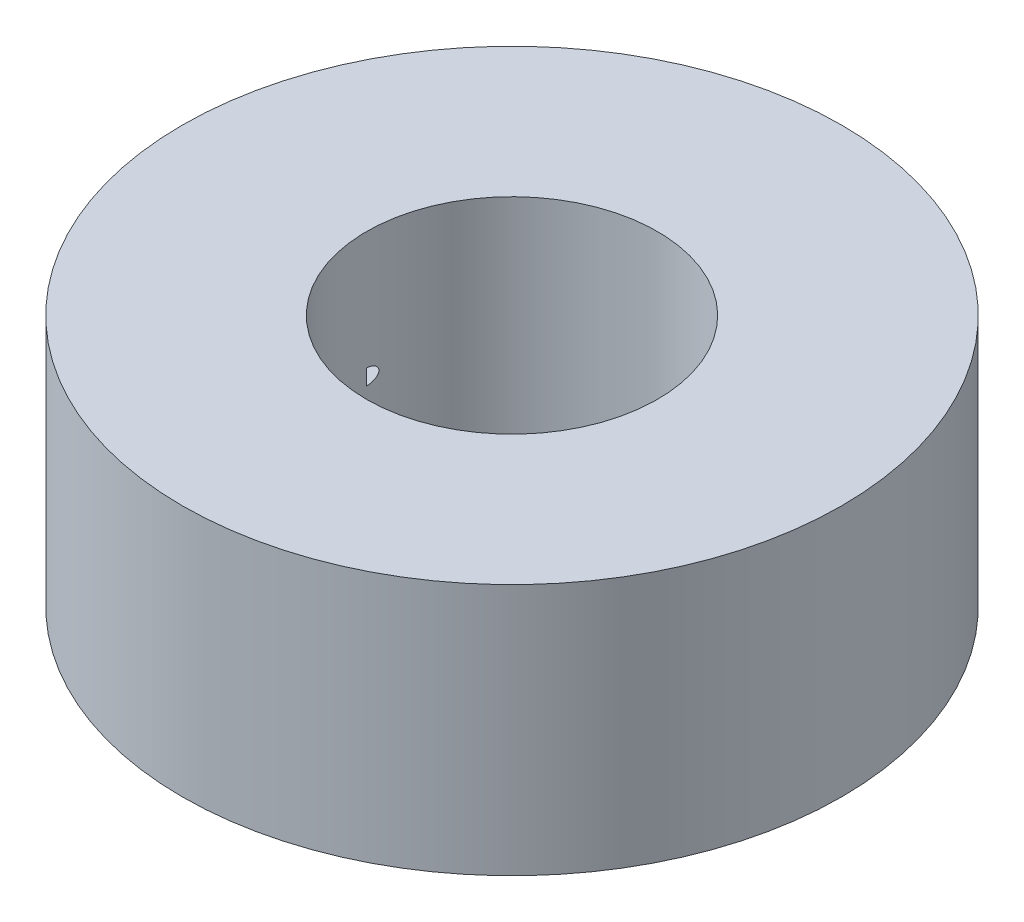
ISO-10303-21;
HEADER;
FILE_DESCRIPTION(('STEP AP214'),'2;1');
FILE_NAME('part.step','',(''),(''),'','','');
FILE_SCHEMA(('AUTOMOTIVE_DESIGN { 1 0 10303 214 1 1 1 1 }'));
ENDSEC;
DATA;
#1=APPLICATION_CONTEXT('core data for automotive mechanical design processes');
#2=APPLICATION_PROTOCOL_DEFINITION('international standard','automotive_design',2000,#1);
#3=PRODUCT_CONTEXT('',#1,'mechanical');
#4=PRODUCT('Part','Part','',(#3));
#5=PRODUCT_RELATED_PRODUCT_CATEGORY('part','',(#4));
#6=PRODUCT_DEFINITION_FORMATION('','',#4);
#7=PRODUCT_DEFINITION_CONTEXT('part definition',#1,'design');
#8=PRODUCT_DEFINITION('design','',#6,#7);
#9=PRODUCT_DEFINITION_SHAPE('','',#8);
#10=(LENGTH_UNIT() NAMED_UNIT(*) SI_UNIT(.MILLI.,.METRE.));
#11=(NAMED_UNIT(*) PLANE_ANGLE_UNIT() SI_UNIT($,.RADIAN.));
#12=(NAMED_UNIT(*) SI_UNIT($,.STERADIAN.) SOLID_ANGLE_UNIT());
#13=UNCERTAINTY_MEASURE_WITH_UNIT(LENGTH_MEASURE(1.E-05),#10,'distance_accuracy_value','');
#14=(GEOMETRIC_REPRESENTATION_CONTEXT(3) GLOBAL_UNCERTAINTY_ASSIGNED_CONTEXT((#13)) GLOBAL_UNIT_ASSIGNED_CONTEXT((#10,
#11,#12)) REPRESENTATION_CONTEXT('',''));
#15=CARTESIAN_POINT('',(0.,0.,0.));
#16=DIRECTION('',(0.,0.,1.));
#17=DIRECTION('',(1.,0.,0.));
#18=AXIS2_PLACEMENT_3D('',#15,#16,#17);
#19=CARTESIAN_POINT('',(0.,13.,0.));
#20=DIRECTION('',(0.,1.,0.));
#21=DIRECTION('',(0.,0.,1.));
#22=AXIS2_PLACEMENT_3D('',#19,#20,#21);
#23=PLANE('',#22);
#24=CARTESIAN_POINT('',(0.,13.,0.));
#25=DIRECTION('',(0.,1.,0.));
#26=DIRECTION('',(0.,0.,1.));
#27=AXIS2_PLACEMENT_3D('',#24,#25,#26);
#28=CIRCLE('',#27,17.);
#29=CARTESIAN_POINT('',(0.,13.,17.));
#30=VERTEX_POINT('',#29);
#31=EDGE_CURVE('E71',#30,#30,#28,.T.);
#32=ORIENTED_EDGE('',*,*,#31,.T.);
#33=EDGE_LOOP('',(#32));
#34=FACE_BOUND('',#33,.T.);
#35=CARTESIAN_POINT('',(0.,13.,0.));
#36=DIRECTION('',(0.,1.,0.));
#37=DIRECTION('',(0.,0.,1.));
#38=AXIS2_PLACEMENT_3D('',#35,#36,#37);
#39=CIRCLE('',#38,7.5);
#40=CARTESIAN_POINT('',(0.,13.,7.5));
#41=VERTEX_POINT('',#40);
#42=EDGE_CURVE('E84',#41,#41,#39,.T.);
#43=ORIENTED_EDGE('',*,*,#42,.F.);
#44=EDGE_LOOP('',(#43));
#45=FACE_BOUND('',#44,.T.);
#46=ADVANCED_FACE('F43',(#34,#45),#23,.T.);
#47=CARTESIAN_POINT('',(0.,0.,0.));
#48=DIRECTION('',(0.,1.,0.));
#49=DIRECTION('',(0.,0.,1.));
#50=AXIS2_PLACEMENT_3D('',#47,#48,#49);
#51=PLANE('',#50);
#52=CARTESIAN_POINT('',(0.,0.,0.));
#53=DIRECTION('',(0.,1.,0.));
#54=DIRECTION('',(0.,0.,1.));
#55=AXIS2_PLACEMENT_3D('',#52,#53,#54);
#56=CIRCLE('',#55,17.);
#57=CARTESIAN_POINT('',(0.,0.,17.));
#58=VERTEX_POINT('',#57);
#59=EDGE_CURVE('E93',#58,#58,#56,.T.);
#60=ORIENTED_EDGE('',*,*,#59,.F.);
#61=EDGE_LOOP('',(#60));
#62=FACE_BOUND('',#61,.T.);
#63=CARTESIAN_POINT('',(0.,0.,0.));
#64=DIRECTION('',(0.,1.,0.));
#65=DIRECTION('',(0.,0.,1.));
#66=AXIS2_PLACEMENT_3D('',#63,#64,#65);
#67=CIRCLE('',#66,7.5);
#68=CARTESIAN_POINT('',(0.,0.,7.5));
#69=VERTEX_POINT('',#68);
#70=EDGE_CURVE('E87',#69,#69,#67,.T.);
#71=ORIENTED_EDGE('',*,*,#70,.T.);
#72=EDGE_LOOP('',(#71));
#73=FACE_BOUND('',#72,.T.);
#74=ADVANCED_FACE('F106',(#62,#73),#51,.F.);
#75=CARTESIAN_POINT('',(0.,13.,0.));
#76=DIRECTION('',(0.,-1.,0.));
#77=DIRECTION('',(0.,0.,-1.));
#78=AXIS2_PLACEMENT_3D('',#75,#76,#77);
#79=CYLINDRICAL_SURFACE('',#78,17.);
#80=CARTESIAN_POINT('',(-7.475,6.5,-15.2684110175224));
#81=CARTESIAN_POINT('',(-7.47500759504641,6.66343449378337,-15.2684088996109));
#82=CARTESIAN_POINT('',(-7.48767649308095,6.82693018495944,-15.2622249028304));
#83=CARTESIAN_POINT('',(-7.53779248223485,7.14916430516422,-15.2375338182105));
#84=CARTESIAN_POINT('',(-7.57525282552799,7.30790014236735,-15.2190201395526));
#85=CARTESIAN_POINT('',(-7.67315757281746,7.6158366823646,-15.1698919898576));
#86=CARTESIAN_POINT('',(-7.7335659457595,7.76505190683336,-15.1392964857204));
#87=CARTESIAN_POINT('',(-7.87469379615572,8.05036863613705,-15.0663690071125));
#88=CARTESIAN_POINT('',(-7.95541250038644,8.18647063992547,-15.0240374794312));
#89=CARTESIAN_POINT('',(-8.13623257015441,8.44609826793165,-14.9269051506459));
#90=CARTESIAN_POINT('',(-8.23680001232593,8.56918300173224,-14.8717974618524));
#91=CARTESIAN_POINT('',(-8.45181445084686,8.79632080040588,-14.7506627217098));
#92=CARTESIAN_POINT('',(-8.56626503615109,8.90036892658205,-14.6846328452363));
#93=CARTESIAN_POINT('',(-8.81564939579281,9.09675894933656,-14.5364074195656));
#94=CARTESIAN_POINT('',(-8.95149958520011,9.18724065319495,-14.4532970017542));
#95=CARTESIAN_POINT('',(-9.23017215644443,9.34435305175559,-14.2769451261159));
#96=CARTESIAN_POINT('',(-9.37299788772716,9.41097215782768,-14.183698774449));
#97=CARTESIAN_POINT('',(-9.68229608359314,9.5290853394495,-13.9747169315902));
#98=CARTESIAN_POINT('',(-9.84922654002488,9.57704858940845,-13.8576729815623));
#99=CARTESIAN_POINT('',(-10.1823131410459,9.64496944922897,-13.6148117643494));
#100=CARTESIAN_POINT('',(-10.3484688513516,9.6649128836442,-13.4889900902051));
#101=CARTESIAN_POINT('',(-10.707834345909,9.68048613446572,-13.2062088463142));
#102=CARTESIAN_POINT('',(-10.9001864082182,9.67077660446095,-13.0478751348036));
#103=CARTESIAN_POINT('',(-11.2753064795698,9.61858046218148,-12.7251246004236));
#104=CARTESIAN_POINT('',(-11.458064047701,9.57605890179027,-12.5607014695869));
#105=CARTESIAN_POINT('',(-11.7401429456633,9.4840472388896,-12.295938237365));
#106=CARTESIAN_POINT('',(-11.8434884422771,9.44421902186781,-12.1963897925465));
#107=CARTESIAN_POINT('',(-12.0453134401381,9.35410873835973,-11.997104056725));
#108=CARTESIAN_POINT('',(-12.1437939447448,9.30382883867025,-11.8973668091038));
#109=CARTESIAN_POINT('',(-12.3354920802252,9.19295571011705,-11.6984920587124));
#110=CARTESIAN_POINT('',(-12.4287080107939,9.13235917435941,-11.5993547588339));
#111=CARTESIAN_POINT('',(-12.6093317025306,9.00082298777691,-11.4027444347095));
#112=CARTESIAN_POINT('',(-12.6967414375217,8.92988687836992,-11.3052708533404));
#113=CARTESIAN_POINT('',(-12.9017194836116,8.74431780268388,-11.0715430990724));
#114=CARTESIAN_POINT('',(-13.0159670299532,8.62406035925907,-10.9367632008247));
#115=CARTESIAN_POINT('',(-13.2287432408449,8.35995023630518,-10.6783977605614));
#116=CARTESIAN_POINT('',(-13.3273013786682,8.21614285306154,-10.5547914219646));
#117=CARTESIAN_POINT('',(-13.4753866938656,7.95345998299938,-10.36453010001));
#118=CARTESIAN_POINT('',(-13.5304356332074,7.84168539303104,-10.2924266638517));
#119=CARTESIAN_POINT('',(-13.628948558485,7.60578617360689,-10.1616157344114));
#120=CARTESIAN_POINT('',(-13.6724311091888,7.4816817794918,-10.1028867963034));
#121=CARTESIAN_POINT('',(-13.736993922554,7.24986710750895,-10.0148559321733));
#122=CARTESIAN_POINT('',(-13.7608767642558,7.14433019568585,-9.98194638393483));
#123=CARTESIAN_POINT('',(-13.7979313937265,6.9279666526358,-9.93066502127737));
#124=CARTESIAN_POINT('',(-13.8111153992489,6.81714620866538,-9.91227662478103));
#125=CARTESIAN_POINT('',(-13.8256508275,6.59260246118597,-9.8919944479524));
#126=CARTESIAN_POINT('',(-13.8269407691124,6.4788671187164,-9.89018637253833));
#127=CARTESIAN_POINT('',(-13.8173915479639,6.25290264584977,-9.90352198984109));
#128=CARTESIAN_POINT('',(-13.8065475915965,6.140674128469,-9.91867238215523));
#129=CARTESIAN_POINT('',(-13.7749103267186,5.92881963075548,-9.96255462961252));
#130=CARTESIAN_POINT('',(-13.7548643053207,5.82886077252776,-9.9902646988287));
#131=CARTESIAN_POINT('',(-13.7064777492401,5.63479157865507,-10.0565478300734));
#132=CARTESIAN_POINT('',(-13.678133923658,5.54068358144209,-10.0951252018315));
#133=CARTESIAN_POINT('',(-13.5940457074684,5.30075446684918,-10.2083061598827));
#134=CARTESIAN_POINT('',(-13.5323817244905,5.16043877208655,-10.2901545002255));
#135=CARTESIAN_POINT('',(-13.3947673424735,4.89716525312842,-10.4686663588138));
#136=CARTESIAN_POINT('',(-13.3187702851989,4.77426648114196,-10.5653780656582));
#137=CARTESIAN_POINT('',(-13.1739750073254,4.57074678129132,-10.7450719782249));
#138=CARTESIAN_POINT('',(-13.1074279005956,4.48684649241124,-10.8262213514806));
#139=CARTESIAN_POINT('',(-12.9684035931134,4.32818832768357,-10.9923719100638));
#140=CARTESIAN_POINT('',(-12.8959232018327,4.25343542531294,-11.0773751566429));
#141=CARTESIAN_POINT('',(-12.7456460230897,4.11263787426503,-11.2499607278766));
#142=CARTESIAN_POINT('',(-12.6678456427969,4.04659920067067,-11.3375447722845));
#143=CARTESIAN_POINT('',(-12.5074466582028,3.92303206704372,-11.5142529153891));
#144=CARTESIAN_POINT('',(-12.4248488569056,3.86550218847253,-11.6033767546066));
#145=CARTESIAN_POINT('',(-12.2516599574633,3.75660737849578,-11.7861494949845));
#146=CARTESIAN_POINT('',(-12.1608791309981,3.70559992504822,-11.8798320187006));
#147=CARTESIAN_POINT('',(-11.9748545394187,3.61275290599283,-12.0673256460899));
#148=CARTESIAN_POINT('',(-11.8796092916404,3.57091641268485,-12.1611367822905));
#149=CARTESIAN_POINT('',(-11.5878385248483,3.45953649373259,-12.4416429160165));
#150=CARTESIAN_POINT('',(-11.385044162391,3.40397581827145,-12.627658998711));
#151=CARTESIAN_POINT('',(-10.9747171706178,3.33507573749686,-12.9856418852582));
#152=CARTESIAN_POINT('',(-10.7676786416428,3.32017263032528,-13.1578736610158));
#153=CARTESIAN_POINT('',(-10.3463250381998,3.33255192786816,-13.4916826046523));
#154=CARTESIAN_POINT('',(-10.1320177886148,3.35979029342172,-13.6532707115733));
#155=CARTESIAN_POINT('',(-9.74422671905185,3.45173540851405,-13.9318233762862));
#156=CARTESIAN_POINT('',(-9.57075185978426,3.5083059216507,-14.0514210920509));
#157=CARTESIAN_POINT('',(-9.31487087845024,3.61786728263015,-14.2212431192798));
#158=CARTESIAN_POINT('',(-9.23026517468942,3.65852716134644,-14.2762753797456));
#159=CARTESIAN_POINT('',(-9.06334724208499,3.74825071642088,-14.3828199439169));
#160=CARTESIAN_POINT('',(-8.98103400025367,3.79731061023359,-14.4343338174174));
#161=CARTESIAN_POINT('',(-8.818914116816,3.90437479294155,-14.5339565682965));
#162=CARTESIAN_POINT('',(-8.73913608265938,3.9624543504881,-14.5820313017512));
#163=CARTESIAN_POINT('',(-8.58395308582577,4.08712342065501,-14.6739182071168));
#164=CARTESIAN_POINT('',(-8.5085458183436,4.15370838772184,-14.7177326339981));
#165=CARTESIAN_POINT('',(-8.36318839752624,4.29514207116197,-14.8008138164617));
#166=CARTESIAN_POINT('',(-8.29323714004673,4.36998910807895,-14.8400814929628));
#167=CARTESIAN_POINT('',(-8.15991591327914,4.52750255216234,-14.9138048852172));
#168=CARTESIAN_POINT('',(-8.09654459359628,4.61016734821617,-14.9482615888246));
#169=CARTESIAN_POINT('',(-7.98600126877898,4.77031670338444,-15.0075694055642));
#170=CARTESIAN_POINT('',(-7.93780865244759,4.84685152167109,-15.0330895116214));
#171=CARTESIAN_POINT('',(-7.84771529209526,5.00464822670698,-15.0803167022242));
#172=CARTESIAN_POINT('',(-7.80581357221314,5.08590937757553,-15.1020243782533));
#173=CARTESIAN_POINT('',(-7.72893273468596,5.25244641788726,-15.1415147197756));
#174=CARTESIAN_POINT('',(-7.69394578224846,5.33771762647093,-15.1593018301398));
#175=CARTESIAN_POINT('',(-7.63135186584927,5.51160066703146,-15.1909082515385));
#176=CARTESIAN_POINT('',(-7.60374316822038,5.60021170865493,-15.2047284947237));
#177=CARTESIAN_POINT('',(-7.54540634364697,5.82138986443807,-15.2337905045966));
#178=CARTESIAN_POINT('',(-7.51907037677765,5.95545178362204,-15.2467693623573));
#179=CARTESIAN_POINT('',(-7.48386550949665,6.22632847908405,-15.2640797706376));
#180=CARTESIAN_POINT('',(-7.47499364003958,6.36314278343705,-15.2684127910249));
#181=CARTESIAN_POINT('',(-7.475,6.5,-15.2684110175224));
#182=B_SPLINE_CURVE_WITH_KNOTS('',3,(#80,#81,#82,#83,#84,#85,#86,#87,#88,#89,#90,#91,#92,#93,
#94,#95,#96,#97,#98,#99,#100,#101,#102,#103,#104,#105,#106,#107,#108,#109,#110,#111,#112,#113,
#114,#115,#116,#117,#118,#119,#120,#121,#122,#123,#124,#125,#126,#127,#128,#129,#130,#131,#132,
#133,#134,#135,#136,#137,#138,#139,#140,#141,#142,#143,#144,#145,#146,#147,#148,#149,#150,#151,
#152,#153,#154,#155,#156,#157,#158,#159,#160,#161,#162,#163,#164,#165,#166,#167,#168,#169,#170,
#171,#172,#173,#174,#175,#176,#177,#178,#179,#180,#181),.UNSPECIFIED.,.T.,.F.,(4,2,2,2,2,2,2,2,
2,2,2,2,2,2,2,2,2,2,2,2,2,2,2,2,2,2,2,2,2,2,2,2,2,2,2,2,2,2,2,2,2,2,2,2,2,2,2,2,2,2,4),(0.,
0.48981092836701,0.979883895031607,1.4691905498274,1.95847857931629,2.46102915535442,
2.96370992457249,3.5110323143909,4.05862014658662,4.68460356572833,5.31090356093743,
6.05619664738001,6.80228464355319,7.24864695756506,7.69491682583388,8.14133001167331,
8.58759065381618,9.22699455499551,9.8651827591489,10.2958284939788,10.7257787869809,
11.0637405365946,11.4013157986479,11.7406350349961,12.0800883698291,12.3958481537543,
12.7117333376784,13.230038332244,13.7500606266585,14.1526263725632,14.5554100319072,
14.9584684484321,15.3614595933905,15.781268756447,16.2012183426636,17.040013729862,
17.8460611126369,18.6512667194097,19.3029120149182,19.6290031883382,19.9549479065162,
20.2837753486431,20.6124277847707,20.9410135373033,21.2695317206263,21.5510699834908,
21.8325645281401,22.1137382728571,22.3948458920258,22.8050748348124,23.2152340291577),.UNSPECIFIED.);
#183=CARTESIAN_POINT('',(-7.475,6.5,-15.2684110175224));
#184=VERTEX_POINT('',#183);
#185=EDGE_CURVE('E76',#184,#184,#182,.T.);
#186=ORIENTED_EDGE('',*,*,#185,.T.);
#187=EDGE_LOOP('',(#186));
#188=FACE_BOUND('',#187,.T.);
#189=ORIENTED_EDGE('',*,*,#31,.F.);
#190=EDGE_LOOP('',(#189));
#191=FACE_BOUND('',#190,.T.);
#192=ORIENTED_EDGE('',*,*,#59,.T.);
#193=EDGE_LOOP('',(#192));
#194=FACE_BOUND('',#193,.T.);
#195=ADVANCED_FACE('F45',(#188,#191,#194),#79,.T.);
#196=CARTESIAN_POINT('',(0.,13.,0.));
#197=DIRECTION('',(0.,-1.,0.));
#198=DIRECTION('',(0.,0.,-1.));
#199=AXIS2_PLACEMENT_3D('',#196,#197,#198);
#200=CYLINDRICAL_SURFACE('',#199,7.5);
#201=CARTESIAN_POINT('',(-7.5,6.10235065698534,0.));
#202=CARTESIAN_POINT('',(-7.50001716075797,6.10243344655008,-0.0454279085965253));
#203=CARTESIAN_POINT('',(-7.49958791711057,6.1056352670304,-0.0910029819151988));
#204=CARTESIAN_POINT('',(-7.49793357294347,6.11895139460656,-0.181664877714916));
#205=CARTESIAN_POINT('',(-7.49669885911321,6.12914927680271,-0.226739025785009));
#206=CARTESIAN_POINT('',(-7.49396304701072,6.1533722958314,-0.302585977917393));
#207=CARTESIAN_POINT('',(-7.49262430612961,6.1656164179316,-0.333929682771217));
#208=CARTESIAN_POINT('',(-7.489684823502,6.19463204321492,-0.394365059074159));
#209=CARTESIAN_POINT('',(-7.48808514308074,6.21138537832505,-0.423465177693709));
#210=CARTESIAN_POINT('',(-7.48533965105117,6.24364755167456,-0.469074474063028));
#211=CARTESIAN_POINT('',(-7.48421769748352,6.25775194375407,-0.486575918249042));
#212=CARTESIAN_POINT('',(-7.48201924898686,6.28843577938129,-0.519282753501265));
#213=CARTESIAN_POINT('',(-7.48094269964314,6.30501214563787,-0.534490952682823));
#214=CARTESIAN_POINT('',(-7.47917634998602,6.33662179365537,-0.558599555793345));
#215=CARTESIAN_POINT('',(-7.47845416196766,6.35115527154433,-0.56814856653045));
#216=CARTESIAN_POINT('',(-7.47717228454231,6.38159163701985,-0.584777100161183));
#217=CARTESIAN_POINT('',(-7.47661248391811,6.39749357763785,-0.591858313892291));
#218=CARTESIAN_POINT('',(-7.47571746891675,6.43050357185406,-0.603059674508457));
#219=CARTESIAN_POINT('',(-7.4753844327826,6.44762162588868,-0.607151129145431));
#220=CARTESIAN_POINT('',(-7.47500192670921,6.48233111198766,-0.611843428865015));
#221=CARTESIAN_POINT('',(-7.47495219558384,6.49992209300785,-0.612447489072554));
#222=CARTESIAN_POINT('',(-7.47512910018336,6.53230390993245,-0.610282871933757));
#223=CARTESIAN_POINT('',(-7.47531654955594,6.5471295151756,-0.607992479101381));
#224=CARTESIAN_POINT('',(-7.47588114597646,6.57619647097616,-0.601010196547026));
#225=CARTESIAN_POINT('',(-7.47625833767581,6.59043768315681,-0.596317741551652));
#226=CARTESIAN_POINT('',(-7.47717460712195,6.61833666058154,-0.584717042581353));
#227=CARTESIAN_POINT('',(-7.47771705221661,6.63197479361777,-0.577762482603257));
#228=CARTESIAN_POINT('',(-7.47891435981508,6.65815441443613,-0.562051890374477));
#229=CARTESIAN_POINT('',(-7.47956927083218,6.67069542542522,-0.553295080380478));
#230=CARTESIAN_POINT('',(-7.48136997515617,6.70194839603342,-0.528522331365632));
#231=CARTESIAN_POINT('',(-7.4825708316621,6.71973793223909,-0.51134432601143));
#232=CARTESIAN_POINT('',(-7.48500465228084,6.75238466902359,-0.474396080763011));
#233=CARTESIAN_POINT('',(-7.48623769490165,6.76723375495997,-0.454618911244072));
#234=CARTESIAN_POINT('',(-7.48921763051888,6.80081655282516,-0.403189653554977));
#235=CARTESIAN_POINT('',(-7.49092092949482,6.81789880394988,-0.370460087582898));
#236=CARTESIAN_POINT('',(-7.49396585581245,6.84681546594173,-0.302717523660207));
#237=CARTESIAN_POINT('',(-7.49530638512121,6.85863401280551,-0.267697982954414));
#238=CARTESIAN_POINT('',(-7.49758377565838,6.87816078333009,-0.194090853053847));
#239=CARTESIAN_POINT('',(-7.49848868328055,6.88555139999185,-0.155419386159966));
#240=CARTESIAN_POINT('',(-7.49969800776106,6.89524914750335,-0.0778089951165719));
#241=CARTESIAN_POINT('',(-7.50000817927967,6.89760502026181,-0.0388763301888508));
#242=CARTESIAN_POINT('',(-7.50000000000001,6.89764934301752,-7.59064252474169E-13));
#243=B_SPLINE_CURVE_WITH_KNOTS('',3,(#201,#202,#203,#204,#205,#206,#207,#208,#209,#210,#211,
#212,#213,#214,#215,#216,#217,#218,#219,#220,#221,#222,#223,#224,#225,#226,#227,#228,#229,#230,
#231,#232,#233,#234,#235,#236,#237,#238,#239,#240,#241,#242),.UNSPECIFIED.,.F.,.F.,(4,2,2,2,2,2,
2,2,2,2,2,2,2,2,2,2,2,2,2,2,4),(0.,0.136425464169072,0.274509716310906,0.375248669340082,
0.475587658410184,0.542910114586432,0.610149451932564,0.662171397153557,0.714157628581565,
0.766636436595167,0.819066855215334,0.863863083168763,0.908669857795497,0.954458809617904,
1.00026756280172,1.0741206701228,1.14817483040059,1.25844366528168,1.36904262122239,
1.48684035216354,1.60349240522721),.UNSPECIFIED.);
#244=CARTESIAN_POINT('',(-7.5,6.10235065698534,0.));
#245=VERTEX_POINT('',#244);
#246=CARTESIAN_POINT('',(-7.5,6.89764934301466,0.));
#247=VERTEX_POINT('',#246);
#248=EDGE_CURVE('E11',#245,#247,#243,.T.);
#249=ORIENTED_EDGE('',*,*,#248,.F.);
#250=DIRECTION('',(0.,-1.,0.));
#251=VECTOR('',#250,1.);
#252=CARTESIAN_POINT('',(-7.5,13.,0.));
#253=LINE('',#252,#251);
#254=EDGE_CURVE('E59',#247,#245,#253,.T.);
#255=ORIENTED_EDGE('',*,*,#254,.F.);
#256=EDGE_LOOP('',(#249,#255));
#257=FACE_BOUND('',#256,.T.);
#258=ORIENTED_EDGE('',*,*,#42,.T.);
#259=EDGE_LOOP('',(#258));
#260=FACE_BOUND('',#259,.T.);
#261=ORIENTED_EDGE('',*,*,#70,.F.);
#262=EDGE_LOOP('',(#261));
#263=FACE_BOUND('',#262,.T.);
#264=ADVANCED_FACE('F78',(#257,#260,#263),#200,.F.);
#265=CARTESIAN_POINT('',(-10.65,6.5,-17.));
#266=DIRECTION('',(0.,0.,1.));
#267=DIRECTION('',(1.,0.,0.));
#268=AXIS2_PLACEMENT_3D('',#265,#266,#267);
#269=CYLINDRICAL_SURFACE('',#268,3.175);
#270=ORIENTED_EDGE('',*,*,#248,.T.);
#271=CARTESIAN_POINT('',(-10.65,6.5,0.));
#272=DIRECTION('',(0.,0.,1.));
#273=DIRECTION('',(1.,0.,0.));
#274=AXIS2_PLACEMENT_3D('',#271,#272,#273);
#275=CIRCLE('',#274,3.175);
#276=EDGE_CURVE('E65',#247,#245,#275,.T.);
#277=ORIENTED_EDGE('',*,*,#276,.T.);
#278=EDGE_LOOP('',(#270,#277));
#279=FACE_BOUND('',#278,.T.);
#280=ORIENTED_EDGE('',*,*,#185,.F.);
#281=EDGE_LOOP('',(#280));
#282=FACE_BOUND('',#281,.T.);
#283=ADVANCED_FACE('F73',(#279,#282),#269,.F.);
#284=CARTESIAN_POINT('',(-10.65,6.5,0.));
#285=DIRECTION('',(0.,0.,1.));
#286=DIRECTION('',(1.,0.,0.));
#287=AXIS2_PLACEMENT_3D('',#284,#285,#286);
#288=PLANE('',#287);
#289=ORIENTED_EDGE('',*,*,#254,.T.);
#290=ORIENTED_EDGE('',*,*,#276,.F.);
#291=EDGE_LOOP('',(#289,#290));
#292=FACE_BOUND('',#291,.T.);
#293=ADVANCED_FACE('F67',(#292),#288,.F.);
#294=CLOSED_SHELL('',(#46,#74,#195,#264,#283,#293));
#295=MANIFOLD_SOLID_BREP('B2',#294);
#296=ADVANCED_BREP_SHAPE_REPRESENTATION('',(#18,#295),#14);
#297=SHAPE_DEFINITION_REPRESENTATION(#9,#296);
ENDSEC;
END-ISO-10303-21;
